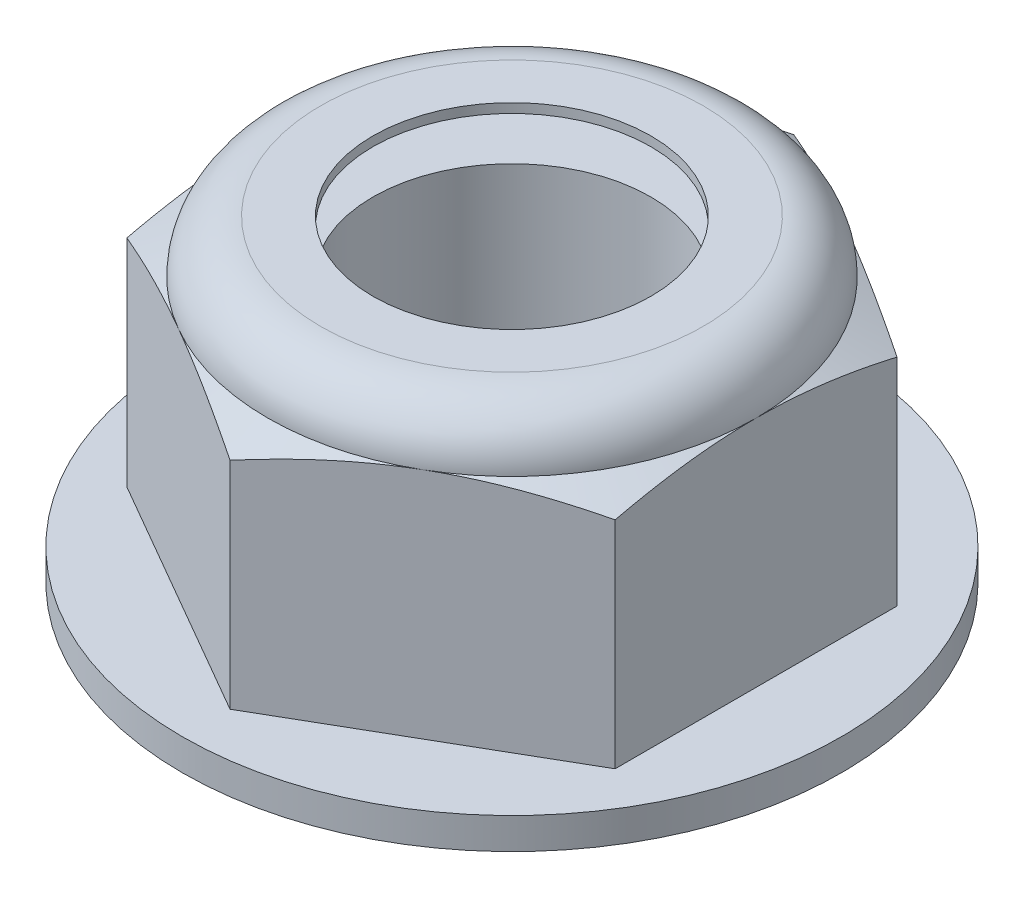
ISO-10303-21;
HEADER;
FILE_DESCRIPTION(('STEP AP214'),'2;1');
FILE_NAME('part.step','',(''),(''),'','','');
FILE_SCHEMA(('AUTOMOTIVE_DESIGN { 1 0 10303 214 1 1 1 1 }'));
ENDSEC;
DATA;
#1=APPLICATION_CONTEXT('core data for automotive mechanical design processes');
#2=APPLICATION_PROTOCOL_DEFINITION('international standard','automotive_design',2000,#1);
#3=PRODUCT_CONTEXT('',#1,'mechanical');
#4=PRODUCT('Part','Part','',(#3));
#5=PRODUCT_RELATED_PRODUCT_CATEGORY('part','',(#4));
#6=PRODUCT_DEFINITION_FORMATION('','',#4);
#7=PRODUCT_DEFINITION_CONTEXT('part definition',#1,'design');
#8=PRODUCT_DEFINITION('design','',#6,#7);
#9=PRODUCT_DEFINITION_SHAPE('','',#8);
#10=(LENGTH_UNIT() NAMED_UNIT(*) SI_UNIT(.MILLI.,.METRE.));
#11=(NAMED_UNIT(*) PLANE_ANGLE_UNIT() SI_UNIT($,.RADIAN.));
#12=(NAMED_UNIT(*) SI_UNIT($,.STERADIAN.) SOLID_ANGLE_UNIT());
#13=UNCERTAINTY_MEASURE_WITH_UNIT(LENGTH_MEASURE(1.E-05),#10,'distance_accuracy_value','');
#14=(GEOMETRIC_REPRESENTATION_CONTEXT(3) GLOBAL_UNCERTAINTY_ASSIGNED_CONTEXT((#13)) GLOBAL_UNIT_ASSIGNED_CONTEXT((#10,
#11,#12)) REPRESENTATION_CONTEXT('',''));
#15=CARTESIAN_POINT('',(0.,0.,0.));
#16=DIRECTION('',(0.,0.,1.));
#17=DIRECTION('',(1.,0.,0.));
#18=AXIS2_PLACEMENT_3D('',#15,#16,#17);
#19=CARTESIAN_POINT('',(0.,4.29947916666666,0.));
#20=DIRECTION('',(0.,-1.,0.));
#21=DIRECTION('',(0.,0.,-1.));
#22=AXIS2_PLACEMENT_3D('',#19,#20,#21);
#23=PLANE('',#22);
#24=CARTESIAN_POINT('',(0.,4.29947916666666,0.));
#25=DIRECTION('',(0.,-1.,0.));
#26=DIRECTION('',(0.,0.,-1.));
#27=AXIS2_PLACEMENT_3D('',#24,#25,#26);
#28=CIRCLE('',#27,2.25956488704734);
#29=CARTESIAN_POINT('',(0.,4.29947916666666,-2.25956488704734));
#30=VERTEX_POINT('',#29);
#31=EDGE_CURVE('E657',#30,#30,#28,.T.);
#32=ORIENTED_EDGE('',*,*,#31,.T.);
#33=EDGE_LOOP('',(#32));
#34=FACE_BOUND('',#33,.T.);
#35=CARTESIAN_POINT('',(0.,4.29947916666666,0.));
#36=DIRECTION('',(0.,-1.,0.));
#37=DIRECTION('',(0.,0.,-1.));
#38=AXIS2_PLACEMENT_3D('',#35,#36,#37);
#39=CIRCLE('',#38,3.81635);
#40=CARTESIAN_POINT('',(0.,4.29947916666666,-3.81635));
#41=VERTEX_POINT('',#40);
#42=EDGE_CURVE('E598',#41,#41,#39,.F.);
#43=ORIENTED_EDGE('',*,*,#42,.T.);
#44=EDGE_LOOP('',(#43));
#45=FACE_BOUND('',#44,.T.);
#46=ADVANCED_FACE('F55',(#34,#45),#23,.F.);
#47=CARTESIAN_POINT('',(0.,4.29947916666666,0.));
#48=DIRECTION('',(0.,-1.,0.));
#49=DIRECTION('',(0.,0.,-1.));
#50=AXIS2_PLACEMENT_3D('',#47,#48,#49);
#51=TOROIDAL_SURFACE('',#50,3.10885416666667,0.707495833333333);
#52=CARTESIAN_POINT('',(0.,5.00697499999999,0.));
#53=DIRECTION('',(0.,1.,0.));
#54=DIRECTION('',(0.,0.,-1.));
#55=AXIS2_PLACEMENT_3D('',#52,#53,#54);
#56=CIRCLE('',#55,3.10885416692067);
#57=CARTESIAN_POINT('',(0.,5.00697499999999,-3.10885416692067));
#58=VERTEX_POINT('',#57);
#59=EDGE_CURVE('E602',#58,#58,#56,.T.);
#60=ORIENTED_EDGE('',*,*,#59,.T.);
#61=EDGE_LOOP('',(#60));
#62=FACE_BOUND('',#61,.T.);
#63=ORIENTED_EDGE('',*,*,#42,.F.);
#64=EDGE_LOOP('',(#63));
#65=FACE_BOUND('',#64,.T.);
#66=ADVANCED_FACE('F621',(#62,#65),#51,.F.);
#67=CARTESIAN_POINT('',(0.,5.006975,-3.10885416666667));
#68=DIRECTION('',(0.,1.,0.));
#69=DIRECTION('',(0.,0.,1.));
#70=AXIS2_PLACEMENT_3D('',#67,#68,#69);
#71=PLANE('',#70);
#72=CARTESIAN_POINT('',(0.,5.006975,0.));
#73=DIRECTION('',(0.,1.,0.));
#74=DIRECTION('',(0.,0.,1.));
#75=AXIS2_PLACEMENT_3D('',#72,#73,#74);
#76=CIRCLE('',#75,2.25956488704734);
#77=CARTESIAN_POINT('',(0.,5.006975,2.25956488704734));
#78=VERTEX_POINT('',#77);
#79=EDGE_CURVE('E60',#78,#78,#76,.T.);
#80=ORIENTED_EDGE('',*,*,#79,.T.);
#81=EDGE_LOOP('',(#80));
#82=FACE_BOUND('',#81,.T.);
#83=ORIENTED_EDGE('',*,*,#59,.F.);
#84=EDGE_LOOP('',(#83));
#85=FACE_BOUND('',#84,.T.);
#86=ADVANCED_FACE('F610',(#82,#85),#71,.F.);
#87=CARTESIAN_POINT('',(0.,5.159375,0.));
#88=DIRECTION('',(0.,1.,0.));
#89=DIRECTION('',(0.,0.,1.));
#90=AXIS2_PLACEMENT_3D('',#87,#88,#89);
#91=CYLINDRICAL_SURFACE('',#90,2.25956488704734);
#92=CARTESIAN_POINT('',(0.,5.159375,0.));
#93=DIRECTION('',(0.,1.,0.));
#94=DIRECTION('',(0.,0.,1.));
#95=AXIS2_PLACEMENT_3D('',#92,#93,#94);
#96=CIRCLE('',#95,2.25956488704734);
#97=CARTESIAN_POINT('',(0.,5.159375,2.25956488704734));
#98=VERTEX_POINT('',#97);
#99=EDGE_CURVE('E918',#98,#98,#96,.T.);
#100=ORIENTED_EDGE('',*,*,#99,.T.);
#101=EDGE_LOOP('',(#100));
#102=FACE_BOUND('',#101,.T.);
#103=ORIENTED_EDGE('',*,*,#79,.F.);
#104=EDGE_LOOP('',(#103));
#105=FACE_BOUND('',#104,.T.);
#106=ADVANCED_FACE('F620',(#102,#105),#91,.F.);
#107=ORIENTED_EDGE('',*,*,#31,.F.);
#108=EDGE_LOOP('',(#107));
#109=FACE_BOUND('',#108,.T.);
#110=CARTESIAN_POINT('',(0.,0.,0.));
#111=DIRECTION('',(0.,1.,0.));
#112=DIRECTION('',(0.,0.,1.));
#113=AXIS2_PLACEMENT_3D('',#110,#111,#112);
#114=CIRCLE('',#113,2.25956488704734);
#115=CARTESIAN_POINT('',(0.,0.,2.25956488704734));
#116=VERTEX_POINT('',#115);
#117=EDGE_CURVE('E603',#116,#116,#114,.T.);
#118=ORIENTED_EDGE('',*,*,#117,.F.);
#119=EDGE_LOOP('',(#118));
#120=FACE_BOUND('',#119,.T.);
#121=ADVANCED_FACE('F646',(#109,#120),#91,.F.);
#122=CARTESIAN_POINT('',(0.,5.159375,-4.58271776169266));
#123=DIRECTION('',(0.,1.,0.));
#124=DIRECTION('',(0.,0.,1.));
#125=AXIS2_PLACEMENT_3D('',#122,#123,#124);
#126=PLANE('',#125);
#127=ORIENTED_EDGE('',*,*,#99,.F.);
#128=EDGE_LOOP('',(#127));
#129=FACE_BOUND('',#128,.T.);
#130=CARTESIAN_POINT('',(0.,5.15937499999999,0.));
#131=DIRECTION('',(0.,-1.,0.));
#132=DIRECTION('',(0.,0.,-1.));
#133=AXIS2_PLACEMENT_3D('',#130,#131,#132);
#134=CIRCLE('',#133,3.10885416692067);
#135=CARTESIAN_POINT('',(0.,5.15937499999999,-3.10885416692067));
#136=VERTEX_POINT('',#135);
#137=EDGE_CURVE('E189',#136,#136,#134,.T.);
#138=ORIENTED_EDGE('',*,*,#137,.F.);
#139=EDGE_LOOP('',(#138));
#140=FACE_BOUND('',#139,.T.);
#141=ADVANCED_FACE('F57',(#129,#140),#126,.T.);
#142=CARTESIAN_POINT('',(0.,4.29947916666666,0.));
#143=DIRECTION('',(0.,-1.,0.));
#144=DIRECTION('',(0.,0.,-1.));
#145=AXIS2_PLACEMENT_3D('',#142,#143,#144);
#146=TOROIDAL_SURFACE('',#145,3.10885416666667,0.859895833333333);
#147=ORIENTED_EDGE('',*,*,#137,.T.);
#148=EDGE_LOOP('',(#147));
#149=FACE_BOUND('',#148,.T.);
#150=CARTESIAN_POINT('',(0.,4.29947916663309,0.));
#151=DIRECTION('',(0.,-1.,0.));
#152=DIRECTION('',(0.,0.,-1.));
#153=AXIS2_PLACEMENT_3D('',#150,#151,#152);
#154=CIRCLE('',#153,3.96875000001273);
#155=CARTESIAN_POINT('',(3.96875000000637,4.29947916663606,0.));
#156=VERTEX_POINT('',#155);
#157=CARTESIAN_POINT('',(1.98437500000318,4.29947916663606,3.437038321275));
#158=VERTEX_POINT('',#157);
#159=EDGE_CURVE('E541',#156,#158,#154,.T.);
#160=ORIENTED_EDGE('',*,*,#159,.F.);
#161=CARTESIAN_POINT('',(0.,4.29947916663309,0.));
#162=DIRECTION('',(0.,-1.,0.));
#163=DIRECTION('',(0.,0.,-1.));
#164=AXIS2_PLACEMENT_3D('',#161,#162,#163);
#165=CIRCLE('',#164,3.96875000001273);
#166=CARTESIAN_POINT('',(1.98437500000318,4.29947916663606,-3.437038321275));
#167=VERTEX_POINT('',#166);
#168=EDGE_CURVE('E172',#167,#156,#165,.T.);
#169=ORIENTED_EDGE('',*,*,#168,.F.);
#170=CARTESIAN_POINT('',(0.,4.29947916663309,0.));
#171=DIRECTION('',(0.,-1.,0.));
#172=DIRECTION('',(0.,0.,-1.));
#173=AXIS2_PLACEMENT_3D('',#170,#171,#172);
#174=CIRCLE('',#173,3.96875000001273);
#175=CARTESIAN_POINT('',(-1.98437500000319,4.29947916663606,-3.43703832127501));
#176=VERTEX_POINT('',#175);
#177=EDGE_CURVE('E168',#176,#167,#174,.T.);
#178=ORIENTED_EDGE('',*,*,#177,.F.);
#179=CARTESIAN_POINT('',(0.,4.29947916663309,0.));
#180=DIRECTION('',(0.,-1.,0.));
#181=DIRECTION('',(0.,0.,-1.));
#182=AXIS2_PLACEMENT_3D('',#179,#180,#181);
#183=CIRCLE('',#182,3.96875000001273);
#184=CARTESIAN_POINT('',(-3.96875000000637,4.29947916663606,0.));
#185=VERTEX_POINT('',#184);
#186=EDGE_CURVE('E182',#185,#176,#183,.T.);
#187=ORIENTED_EDGE('',*,*,#186,.F.);
#188=CARTESIAN_POINT('',(0.,4.29947916663309,0.));
#189=DIRECTION('',(0.,-1.,0.));
#190=DIRECTION('',(0.,0.,-1.));
#191=AXIS2_PLACEMENT_3D('',#188,#189,#190);
#192=CIRCLE('',#191,3.96875000001273);
#193=CARTESIAN_POINT('',(-1.98437500000318,4.29947916663606,3.43703832127501));
#194=VERTEX_POINT('',#193);
#195=EDGE_CURVE('E188',#194,#185,#192,.T.);
#196=ORIENTED_EDGE('',*,*,#195,.F.);
#197=CARTESIAN_POINT('',(0.,4.29947916663309,0.));
#198=DIRECTION('',(0.,-1.,0.));
#199=DIRECTION('',(0.,0.,-1.));
#200=AXIS2_PLACEMENT_3D('',#197,#198,#199);
#201=CIRCLE('',#200,3.96875000001273);
#202=EDGE_CURVE('E546',#158,#194,#201,.T.);
#203=ORIENTED_EDGE('',*,*,#202,.F.);
#204=EDGE_LOOP('',(#160,#169,#178,#187,#196,#203));
#205=FACE_BOUND('',#204,.T.);
#206=ADVANCED_FACE('F196',(#149,#205),#146,.T.);
#207=CARTESIAN_POINT('',(0.,4.01146351026682,0.));
#208=DIRECTION('',(0.,-1.,0.));
#209=DIRECTION('',(0.,0.,-1.));
#210=AXIS2_PLACEMENT_3D('',#207,#208,#209);
#211=CONICAL_SURFACE('',#210,4.58640156836054,1.13446401383057);
#212=ORIENTED_EDGE('',*,*,#177,.T.);
#213=CARTESIAN_POINT('',(1.984375,4.29947916663903,-3.43703832126949));
#214=CARTESIAN_POINT('',(1.90068202425308,4.29949063606755,-3.48535848334626));
#215=CARTESIAN_POINT('',(1.81699140878912,4.29783343713999,-3.53367728271302));
#216=CARTESIAN_POINT('',(1.64971517236388,4.29126659423326,-3.63025426284216));
#217=CARTESIAN_POINT('',(1.56612954044007,4.28635732411621,-3.67851244993376));
#218=CARTESIAN_POINT('',(1.39942198510236,4.27339279209317,-3.77476110188393));
#219=CARTESIAN_POINT('',(1.3162994440687,4.26534804900737,-3.82275192332544));
#220=CARTESIAN_POINT('',(1.15031301246905,4.24626834965072,-3.91858423429132));
#221=CARTESIAN_POINT('',(1.06744912557862,4.23523335108123,-3.96642572169361));
#222=CARTESIAN_POINT('',(0.81947163893657,4.19794138638942,-4.10959559035936));
#223=CARTESIAN_POINT('',(0.654830633226207,4.16748584915722,-4.20465111932589));
#224=CARTESIAN_POINT('',(0.326497291191042,4.09704577757764,-4.39421446273382));
#225=CARTESIAN_POINT('',(0.162810026905678,4.05702945278584,-4.48871934883189));
#226=CARTESIAN_POINT('',(-3.31893085215347E-08,4.01318128859175,-4.58271778085451));
#227=B_SPLINE_CURVE_WITH_KNOTS('',3,(#213,#214,#215,#216,#217,#218,#219,#220,#221,#222,#223,
#224,#225,#226),.UNSPECIFIED.,.F.,.F.,(4,2,2,2,2,2,4),(0.,0.289902364590457,0.579771407428602,
0.868676259763257,1.15758519901256,1.73491225609728,2.3141863669809),.UNSPECIFIED.);
#228=CARTESIAN_POINT('',(-3.92447085080745E-08,4.01318130809264,-4.58271773903472));
#229=VERTEX_POINT('',#228);
#230=EDGE_CURVE('E150',#167,#229,#227,.T.);
#231=ORIENTED_EDGE('',*,*,#230,.T.);
#232=CARTESIAN_POINT('',(-7.84924973823098E-08,4.0131813186638,-4.58271771638472));
#233=CARTESIAN_POINT('',(-0.162810129620303,4.05702947859696,-4.48871928953298));
#234=CARTESIAN_POINT('',(-0.326497384841775,4.09704579935415,-4.39421440866544));
#235=CARTESIAN_POINT('',(-0.654830708632123,4.16748586366253,-4.20465107578938));
#236=CARTESIAN_POINT('',(-0.819471705162628,4.19794139765291,-4.10959555212357));
#237=CARTESIAN_POINT('',(-1.06744917787535,4.23523335829211,-3.96642569150016));
#238=CARTESIAN_POINT('',(-1.15031306008803,4.24626835564492,-3.91858420679851));
#239=CARTESIAN_POINT('',(-1.31629948229136,4.26534805288065,-3.82275190125755));
#240=CARTESIAN_POINT('',(-1.39942201860645,4.2733927950622,-3.77476108254033));
#241=CARTESIAN_POINT('',(-1.56612956443773,4.28635732561832,-3.67851243607871));
#242=CARTESIAN_POINT('',(-1.64971519157353,4.29126659517472,-3.63025425175147));
#243=CARTESIAN_POINT('',(-1.81699141840376,4.29783343732903,-3.533677277162));
#244=CARTESIAN_POINT('',(-1.90068202906072,4.29949063606494,-3.48535848057056));
#245=CARTESIAN_POINT('',(-1.984375,4.29947916663903,-3.43703832126949));
#246=B_SPLINE_CURVE_WITH_KNOTS('',3,(#232,#233,#234,#235,#236,#237,#238,#239,#240,#241,#242,
#243,#244,#245),.UNSPECIFIED.,.F.,.F.,(4,2,2,2,2,2,4),(0.,0.579274077705198,1.15660110188365,
1.44551002462398,1.7344148604513,2.02428388664847,2.31418623458842),.UNSPECIFIED.);
#247=EDGE_CURVE('E127',#229,#176,#246,.T.);
#248=ORIENTED_EDGE('',*,*,#247,.T.);
#249=EDGE_LOOP('',(#212,#231,#248));
#250=FACE_BOUND('',#249,.T.);
#251=ADVANCED_FACE('F200',(#250),#211,.T.);
#252=CARTESIAN_POINT('',(0.,4.01146351026682,0.));
#253=DIRECTION('',(0.,-1.,0.));
#254=DIRECTION('',(0.,0.,-1.));
#255=AXIS2_PLACEMENT_3D('',#252,#253,#254);
#256=CONICAL_SURFACE('',#255,4.58640156836054,1.13446401383057);
#257=CARTESIAN_POINT('',(-1.984375,4.29947916663903,-3.43703832126949));
#258=CARTESIAN_POINT('',(-2.06806797431815,4.29949063606677,-3.38871816001764));
#259=CARTESIAN_POINT('',(-2.15175858835351,4.29783343719617,-3.34039936147567));
#260=CARTESIAN_POINT('',(-2.31903482192722,4.29126659451305,-3.24382238299287));
#261=CARTESIAN_POINT('',(-2.40262045242808,4.28635732456262,-3.19556419672281));
#262=CARTESIAN_POINT('',(-2.56932800494057,4.27339279297554,-3.09931554640378));
#263=CARTESIAN_POINT('',(-2.65245054457191,4.26534805015848,-3.0513247257719));
#264=CARTESIAN_POINT('',(-2.81843697337906,4.24626835143213,-2.95549241641827));
#265=CARTESIAN_POINT('',(-2.90130085887931,4.23523335322422,-2.9076509298186));
#266=CARTESIAN_POINT('',(-3.14927834138169,4.19794138973685,-2.76448106354289));
#267=CARTESIAN_POINT('',(-3.31391934436383,4.1674858534682,-2.6694255361515));
#268=CARTESIAN_POINT('',(-3.64225268097702,4.09704578404924,-2.47986219587394));
#269=CARTESIAN_POINT('',(-3.80593994256895,4.05702946045605,-2.38535731133093));
#270=CARTESIAN_POINT('',(-3.96874999999962,4.01318129752717,-2.29135888084656));
#271=B_SPLINE_CURVE_WITH_KNOTS('',3,(#257,#258,#259,#260,#261,#262,#263,#264,#265,#266,#267,
#268,#269,#270),.UNSPECIFIED.,.F.,.F.,(4,2,2,2,2,2,4),(0.,0.289902359642105,0.579771397534721,
0.868676244963538,1.15758517930653,1.73491222661187,2.31418632763527),.UNSPECIFIED.);
#272=CARTESIAN_POINT('',(-3.96874999999981,4.01318129752717,-2.29135888084621));
#273=VERTEX_POINT('',#272);
#274=EDGE_CURVE('E390',#176,#273,#271,.T.);
#275=ORIENTED_EDGE('',*,*,#274,.T.);
#276=CARTESIAN_POINT('',(-3.96875,4.01318129752717,-2.29135888084587));
#277=CARTESIAN_POINT('',(-3.96875,4.05702946045605,-2.10336201987713));
#278=CARTESIAN_POINT('',(-3.96875,4.09704578404925,-1.9143522507911));
#279=CARTESIAN_POINT('',(-3.96875,4.16748585346821,-1.53522557023599));
#280=CARTESIAN_POINT('',(-3.96875,4.19794138973685,-1.34511451545321));
#281=CARTESIAN_POINT('',(-3.96875,4.23523335322423,-1.05877478290179));
#282=CARTESIAN_POINT('',(-3.96875,4.24626835143214,-0.963091809702455));
#283=CARTESIAN_POINT('',(-3.96875,4.26534805015848,-0.771427190995189));
#284=CARTESIAN_POINT('',(-3.96875,4.27339279297554,-0.675445549731429));
#285=CARTESIAN_POINT('',(-3.96875,4.28635732456262,-0.482948249093372));
#286=CARTESIAN_POINT('',(-3.96875,4.29126659451305,-0.386431876553257));
#287=CARTESIAN_POINT('',(-3.96875,4.29783343719618,-0.193277919587646));
#288=CARTESIAN_POINT('',(-3.96875,4.29949063606677,-0.0966403225037178));
#289=CARTESIAN_POINT('',(-3.96875,4.29947916663903,0.));
#290=B_SPLINE_CURVE_WITH_KNOTS('',3,(#276,#277,#278,#279,#280,#281,#282,#283,#284,#285,#286,
#287,#288,#289),.UNSPECIFIED.,.F.,.F.,(4,2,2,2,2,2,4),(0.,0.579274101023395,1.15660114832874,
1.44551008267172,1.73441493010054,2.02428396799316,2.31418632763526),.UNSPECIFIED.);
#291=EDGE_CURVE('E516',#273,#185,#290,.T.);
#292=ORIENTED_EDGE('',*,*,#291,.T.);
#293=ORIENTED_EDGE('',*,*,#186,.T.);
#294=EDGE_LOOP('',(#275,#292,#293));
#295=FACE_BOUND('',#294,.T.);
#296=ADVANCED_FACE('F202',(#295),#256,.T.);
#297=CARTESIAN_POINT('',(0.,4.01146351026682,0.));
#298=DIRECTION('',(0.,-1.,0.));
#299=DIRECTION('',(0.,0.,-1.));
#300=AXIS2_PLACEMENT_3D('',#297,#298,#299);
#301=CONICAL_SURFACE('',#300,4.58640156836054,1.13446401383057);
#302=ORIENTED_EDGE('',*,*,#195,.T.);
#303=CARTESIAN_POINT('',(-3.96875,4.29947916663903,0.));
#304=CARTESIAN_POINT('',(-3.96875,4.29949063606677,0.0966403225037192));
#305=CARTESIAN_POINT('',(-3.96875,4.29783343719618,0.193277919587648));
#306=CARTESIAN_POINT('',(-3.96875,4.29126659451305,0.386431876553259));
#307=CARTESIAN_POINT('',(-3.96875,4.28635732456262,0.482948249093374));
#308=CARTESIAN_POINT('',(-3.96875,4.27339279297554,0.675445549731432));
#309=CARTESIAN_POINT('',(-3.96875,4.26534805015848,0.771427190995192));
#310=CARTESIAN_POINT('',(-3.96875,4.24626835143214,0.963091809702459));
#311=CARTESIAN_POINT('',(-3.96875,4.23523335322423,1.05877478290179));
#312=CARTESIAN_POINT('',(-3.96875,4.19794138973685,1.34511451545322));
#313=CARTESIAN_POINT('',(-3.96875,4.16748585346821,1.535225570236));
#314=CARTESIAN_POINT('',(-3.96875,4.09704578404925,1.9143522507911));
#315=CARTESIAN_POINT('',(-3.96875,4.05702946045605,2.10336201987713));
#316=CARTESIAN_POINT('',(-3.96875,4.01318129752717,2.29135888084588));
#317=B_SPLINE_CURVE_WITH_KNOTS('',3,(#303,#304,#305,#306,#307,#308,#309,#310,#311,#312,#313,
#314,#315,#316),.UNSPECIFIED.,.F.,.F.,(4,2,2,2,2,2,4),(0.,0.289902359642105,0.579771397534722,
0.868676244963539,1.15758517930653,1.73491222661187,2.31418632763527),.UNSPECIFIED.);
#318=CARTESIAN_POINT('',(-3.96874999999981,4.01318129752717,2.29135888084622));
#319=VERTEX_POINT('',#318);
#320=EDGE_CURVE('E510',#185,#319,#317,.T.);
#321=ORIENTED_EDGE('',*,*,#320,.T.);
#322=CARTESIAN_POINT('',(-3.96874999999961,4.01318129752717,2.29135888084656));
#323=CARTESIAN_POINT('',(-3.80593994256894,4.05702946045605,2.38535731133093));
#324=CARTESIAN_POINT('',(-3.64225268097701,4.09704578404925,2.47986219587394));
#325=CARTESIAN_POINT('',(-3.31391934436382,4.16748585346821,2.6694255361515));
#326=CARTESIAN_POINT('',(-3.14927834138168,4.19794138973685,2.76448106354289));
#327=CARTESIAN_POINT('',(-2.9013008588793,4.23523335322422,2.9076509298186));
#328=CARTESIAN_POINT('',(-2.81843697337906,4.24626835143213,2.95549241641826));
#329=CARTESIAN_POINT('',(-2.65245054457191,4.26534805015848,3.0513247257719));
#330=CARTESIAN_POINT('',(-2.56932800494056,4.27339279297554,3.09931554640378));
#331=CARTESIAN_POINT('',(-2.40262045242808,4.28635732456262,3.19556419672281));
#332=CARTESIAN_POINT('',(-2.31903482192721,4.29126659451305,3.24382238299286));
#333=CARTESIAN_POINT('',(-2.15175858835351,4.29783343719618,3.34039936147567));
#334=CARTESIAN_POINT('',(-2.06806797431814,4.29949063606677,3.38871816001763));
#335=CARTESIAN_POINT('',(-1.984375,4.29947916663903,3.43703832126949));
#336=B_SPLINE_CURVE_WITH_KNOTS('',3,(#322,#323,#324,#325,#326,#327,#328,#329,#330,#331,#332,
#333,#334,#335),.UNSPECIFIED.,.F.,.F.,(4,2,2,2,2,2,4),(0.,0.579274101023396,1.15660114832874,
1.44551008267173,1.73441493010054,2.02428396799316,2.31418632763526),.UNSPECIFIED.);
#337=EDGE_CURVE('E492',#319,#194,#336,.T.);
#338=ORIENTED_EDGE('',*,*,#337,.T.);
#339=EDGE_LOOP('',(#302,#321,#338));
#340=FACE_BOUND('',#339,.T.);
#341=ADVANCED_FACE('F472',(#340),#301,.T.);
#342=CARTESIAN_POINT('',(0.,4.01146351026682,0.));
#343=DIRECTION('',(0.,-1.,0.));
#344=DIRECTION('',(0.,0.,-1.));
#345=AXIS2_PLACEMENT_3D('',#342,#343,#344);
#346=CONICAL_SURFACE('',#345,4.58640156836054,1.13446401383057);
#347=ORIENTED_EDGE('',*,*,#202,.T.);
#348=CARTESIAN_POINT('',(-1.984375,4.29947916663903,3.43703832126949));
#349=CARTESIAN_POINT('',(-1.90068202568186,4.29949063606677,3.48535848252135));
#350=CARTESIAN_POINT('',(-1.81699141164649,4.29783343719618,3.53367728106332));
#351=CARTESIAN_POINT('',(-1.64971517807279,4.29126659451305,3.63025425954612));
#352=CARTESIAN_POINT('',(-1.56612954757192,4.28635732456262,3.67851244581618));
#353=CARTESIAN_POINT('',(-1.39942199505944,4.27339279297554,3.77476109613521));
#354=CARTESIAN_POINT('',(-1.3162994554281,4.26534805015848,3.82275191676709));
#355=CARTESIAN_POINT('',(-1.15031302662095,4.24626835143213,3.91858422612072));
#356=CARTESIAN_POINT('',(-1.0674491411207,4.23523335322422,3.96642571272039));
#357=CARTESIAN_POINT('',(-0.819471658618321,4.19794138973685,4.1095955789961));
#358=CARTESIAN_POINT('',(-0.654830655636181,4.16748585346821,4.20465110638749));
#359=CARTESIAN_POINT('',(-0.32649731902299,4.09704578404925,4.39421444666504));
#360=CARTESIAN_POINT('',(-0.162810057431059,4.05702946045605,4.48871933120806));
#361=CARTESIAN_POINT('',(-3.93154487261169E-13,4.01318129752717,4.58271776169243));
#362=B_SPLINE_CURVE_WITH_KNOTS('',3,(#348,#349,#350,#351,#352,#353,#354,#355,#356,#357,#358,
#359,#360,#361),.UNSPECIFIED.,.F.,.F.,(4,2,2,2,2,2,4),(0.,0.289902359642104,0.57977139753472,
0.868676244963536,1.15758517930652,1.73491222661186,2.31418632763526),.UNSPECIFIED.);
#363=CARTESIAN_POINT('',(0.,4.01318129752717,4.58271776169243));
#364=VERTEX_POINT('',#363);
#365=EDGE_CURVE('E483',#194,#364,#362,.T.);
#366=ORIENTED_EDGE('',*,*,#365,.T.);
#367=CARTESIAN_POINT('',(3.83947240191902E-13,4.01318129752717,4.58271776169243));
#368=CARTESIAN_POINT('',(0.162810057431051,4.05702946045605,4.48871933120805));
#369=CARTESIAN_POINT('',(0.326497319022983,4.09704578404925,4.39421444666504));
#370=CARTESIAN_POINT('',(0.654830655636174,4.16748585346821,4.20465110638748));
#371=CARTESIAN_POINT('',(0.819471658618315,4.19794138973685,4.1095955789961));
#372=CARTESIAN_POINT('',(1.06744914112069,4.23523335322423,3.96642571272038));
#373=CARTESIAN_POINT('',(1.15031302662094,4.24626835143214,3.91858422612072));
#374=CARTESIAN_POINT('',(1.31629945542809,4.26534805015848,3.82275191676708));
#375=CARTESIAN_POINT('',(1.39942199505943,4.27339279297554,3.7747610961352));
#376=CARTESIAN_POINT('',(1.56612954757192,4.28635732456262,3.67851244581617));
#377=CARTESIAN_POINT('',(1.64971517807278,4.29126659451306,3.63025425954612));
#378=CARTESIAN_POINT('',(1.81699141164649,4.29783343719618,3.53367728106331));
#379=CARTESIAN_POINT('',(1.90068202568186,4.29949063606678,3.48535848252135));
#380=CARTESIAN_POINT('',(1.984375,4.29947916663903,3.43703832126949));
#381=B_SPLINE_CURVE_WITH_KNOTS('',3,(#367,#368,#369,#370,#371,#372,#373,#374,#375,#376,#377,
#378,#379,#380),.UNSPECIFIED.,.F.,.F.,(4,2,2,2,2,2,4),(0.,0.579274101023398,1.15660114832874,
1.44551008267173,1.73441493010055,2.02428396799316,2.31418632763527),.UNSPECIFIED.);
#382=EDGE_CURVE('E476',#364,#158,#381,.T.);
#383=ORIENTED_EDGE('',*,*,#382,.T.);
#384=EDGE_LOOP('',(#347,#366,#383));
#385=FACE_BOUND('',#384,.T.);
#386=ADVANCED_FACE('F467',(#385),#346,.T.);
#387=CARTESIAN_POINT('',(0.,4.01146351026682,0.));
#388=DIRECTION('',(0.,-1.,0.));
#389=DIRECTION('',(0.,0.,-1.));
#390=AXIS2_PLACEMENT_3D('',#387,#388,#389);
#391=CONICAL_SURFACE('',#390,4.58640156836054,1.13446401383057);
#392=ORIENTED_EDGE('',*,*,#159,.T.);
#393=CARTESIAN_POINT('',(1.984375,4.29947916663903,3.43703832126949));
#394=CARTESIAN_POINT('',(2.06806797431814,4.29949063606678,3.38871816001763));
#395=CARTESIAN_POINT('',(2.15175858835351,4.29783343719618,3.34039936147566));
#396=CARTESIAN_POINT('',(2.31903482192721,4.29126659451305,3.24382238299286));
#397=CARTESIAN_POINT('',(2.40262045242807,4.28635732456262,3.1955641967228));
#398=CARTESIAN_POINT('',(2.56932800494056,4.27339279297554,3.09931554640377));
#399=CARTESIAN_POINT('',(2.6524505445719,4.26534805015848,3.05132472577189));
#400=CARTESIAN_POINT('',(2.81843697337905,4.24626835143214,2.95549241641826));
#401=CARTESIAN_POINT('',(2.9013008588793,4.23523335322423,2.90765092981859));
#402=CARTESIAN_POINT('',(3.14927834138168,4.19794138973685,2.76448106354288));
#403=CARTESIAN_POINT('',(3.31391934436382,4.16748585346821,2.66942553615149));
#404=CARTESIAN_POINT('',(3.64225268097701,4.09704578404925,2.47986219587394));
#405=CARTESIAN_POINT('',(3.80593994256894,4.05702946045605,2.38535731133092));
#406=CARTESIAN_POINT('',(3.96874999999961,4.01318129752717,2.29135888084655));
#407=B_SPLINE_CURVE_WITH_KNOTS('',3,(#393,#394,#395,#396,#397,#398,#399,#400,#401,#402,#403,
#404,#405,#406),.UNSPECIFIED.,.F.,.F.,(4,2,2,2,2,2,4),(0.,0.289902359642104,0.57977139753472,
0.868676244963537,1.15758517930653,1.73491222661187,2.31418632763526),.UNSPECIFIED.);
#408=CARTESIAN_POINT('',(3.9687499999998,4.01318129752717,2.29135888084621));
#409=VERTEX_POINT('',#408);
#410=EDGE_CURVE('E455',#158,#409,#407,.T.);
#411=ORIENTED_EDGE('',*,*,#410,.T.);
#412=CARTESIAN_POINT('',(3.96875,4.01318129752717,2.29135888084588));
#413=CARTESIAN_POINT('',(3.96875,4.05702946045605,2.10336201987713));
#414=CARTESIAN_POINT('',(3.96875,4.09704578404925,1.9143522507911));
#415=CARTESIAN_POINT('',(3.96875,4.16748585346821,1.53522557023599));
#416=CARTESIAN_POINT('',(3.96875,4.19794138973685,1.34511451545322));
#417=CARTESIAN_POINT('',(3.96875,4.23523335322423,1.05877478290179));
#418=CARTESIAN_POINT('',(3.96875,4.24626835143214,0.963091809702457));
#419=CARTESIAN_POINT('',(3.96875,4.26534805015848,0.77142719099519));
#420=CARTESIAN_POINT('',(3.96875,4.27339279297554,0.675445549731431));
#421=CARTESIAN_POINT('',(3.96875,4.28635732456262,0.482948249093373));
#422=CARTESIAN_POINT('',(3.96875,4.29126659451305,0.386431876553258));
#423=CARTESIAN_POINT('',(3.96875,4.29783343719618,0.193277919587647));
#424=CARTESIAN_POINT('',(3.96875,4.29949063606677,0.0966403225037178));
#425=CARTESIAN_POINT('',(3.96875,4.29947916663903,0.));
#426=B_SPLINE_CURVE_WITH_KNOTS('',3,(#412,#413,#414,#415,#416,#417,#418,#419,#420,#421,#422,
#423,#424,#425),.UNSPECIFIED.,.F.,.F.,(4,2,2,2,2,2,4),(0.,0.579274101023397,1.15660114832874,
1.44551008267173,1.73441493010054,2.02428396799316,2.31418632763526),.UNSPECIFIED.);
#427=EDGE_CURVE('E445',#409,#156,#426,.T.);
#428=ORIENTED_EDGE('',*,*,#427,.T.);
#429=EDGE_LOOP('',(#392,#411,#428));
#430=FACE_BOUND('',#429,.T.);
#431=ADVANCED_FACE('F463',(#430),#391,.T.);
#432=CARTESIAN_POINT('',(0.,4.01146351026682,0.));
#433=DIRECTION('',(0.,-1.,0.));
#434=DIRECTION('',(0.,0.,-1.));
#435=AXIS2_PLACEMENT_3D('',#432,#433,#434);
#436=CONICAL_SURFACE('',#435,4.58640156836054,1.13446401383057);
#437=CARTESIAN_POINT('',(3.96875,4.29947916663903,0.));
#438=CARTESIAN_POINT('',(3.96875,4.29949063606677,-0.0966403225037192));
#439=CARTESIAN_POINT('',(3.96875,4.29783343719618,-0.193277919587648));
#440=CARTESIAN_POINT('',(3.96875,4.29126659451305,-0.386431876553259));
#441=CARTESIAN_POINT('',(3.96875,4.28635732456262,-0.482948249093374));
#442=CARTESIAN_POINT('',(3.96875,4.27339279297554,-0.675445549731432));
#443=CARTESIAN_POINT('',(3.96875,4.26534805015848,-0.771427190995192));
#444=CARTESIAN_POINT('',(3.96875,4.24626835143214,-0.963091809702459));
#445=CARTESIAN_POINT('',(3.96875,4.23523335322423,-1.05877478290179));
#446=CARTESIAN_POINT('',(3.96875,4.19794138973685,-1.34511451545322));
#447=CARTESIAN_POINT('',(3.96875,4.16748585346821,-1.535225570236));
#448=CARTESIAN_POINT('',(3.96875,4.09704578404925,-1.9143522507911));
#449=CARTESIAN_POINT('',(3.96875,4.05702946045605,-2.10336201987713));
#450=CARTESIAN_POINT('',(3.96875,4.01318129752717,-2.29135888084588));
#451=B_SPLINE_CURVE_WITH_KNOTS('',3,(#437,#438,#439,#440,#441,#442,#443,#444,#445,#446,#447,
#448,#449,#450),.UNSPECIFIED.,.F.,.F.,(4,2,2,2,2,2,4),(0.,0.289902359642105,0.579771397534721,
0.868676244963538,1.15758517930653,1.73491222661187,2.31418632763527),.UNSPECIFIED.);
#452=CARTESIAN_POINT('',(3.96874999999981,4.01318129752717,-2.29135888084622));
#453=VERTEX_POINT('',#452);
#454=EDGE_CURVE('E438',#156,#453,#451,.T.);
#455=ORIENTED_EDGE('',*,*,#454,.T.);
#456=CARTESIAN_POINT('',(3.96874999999961,4.01318129752717,-2.29135888084656));
#457=CARTESIAN_POINT('',(3.80593994256894,4.05702946045605,-2.38535731133093));
#458=CARTESIAN_POINT('',(3.64225268097701,4.09704578404925,-2.47986219587394));
#459=CARTESIAN_POINT('',(3.31391934436382,4.16748585346821,-2.6694255361515));
#460=CARTESIAN_POINT('',(3.14927834138168,4.19794138973685,-2.76448106354289));
#461=CARTESIAN_POINT('',(2.90130085887931,4.23523335322422,-2.9076509298186));
#462=CARTESIAN_POINT('',(2.81843697337906,4.24626835143213,-2.95549241641826));
#463=CARTESIAN_POINT('',(2.65245054457191,4.26534805015848,-3.0513247257719));
#464=CARTESIAN_POINT('',(2.56932800494057,4.27339279297554,-3.09931554640378));
#465=CARTESIAN_POINT('',(2.40262045242808,4.28635732456262,-3.19556419672281));
#466=CARTESIAN_POINT('',(2.31903482192722,4.29126659451305,-3.24382238299286));
#467=CARTESIAN_POINT('',(2.15175858835351,4.29783343719618,-3.34039936147567));
#468=CARTESIAN_POINT('',(2.06806797431814,4.29949063606677,-3.38871816001763));
#469=CARTESIAN_POINT('',(1.984375,4.29947916663903,-3.43703832126949));
#470=B_SPLINE_CURVE_WITH_KNOTS('',3,(#456,#457,#458,#459,#460,#461,#462,#463,#464,#465,#466,
#467,#468,#469),.UNSPECIFIED.,.F.,.F.,(4,2,2,2,2,2,4),(0.,0.579274101023397,1.15660114832874,
1.44551008267173,1.73441493010054,2.02428396799316,2.31418632763526),.UNSPECIFIED.);
#471=EDGE_CURVE('E415',#453,#167,#470,.T.);
#472=ORIENTED_EDGE('',*,*,#471,.T.);
#473=ORIENTED_EDGE('',*,*,#168,.T.);
#474=EDGE_LOOP('',(#455,#472,#473));
#475=FACE_BOUND('',#474,.T.);
#476=ADVANCED_FACE('F403',(#475),#436,.T.);
#477=CARTESIAN_POINT('',(3.96875,5.159375,-2.29135888084633));
#478=DIRECTION('',(-0.5,0.,0.866025403784439));
#479=DIRECTION('',(0.866025403784439,0.,0.5));
#480=AXIS2_PLACEMENT_3D('',#477,#478,#479);
#481=PLANE('',#480);
#482=ORIENTED_EDGE('',*,*,#230,.F.);
#483=ORIENTED_EDGE('',*,*,#471,.F.);
#484=DIRECTION('',(0.,1.,0.));
#485=VECTOR('',#484,1.);
#486=CARTESIAN_POINT('',(3.96875,5.159375,-2.29135888084633));
#487=LINE('',#486,#485);
#488=CARTESIAN_POINT('',(3.96875,0.507999999999998,-2.29135888084633));
#489=VERTEX_POINT('',#488);
#490=EDGE_CURVE('E76',#489,#453,#487,.T.);
#491=ORIENTED_EDGE('',*,*,#490,.F.);
#492=DIRECTION('',(-0.866025403784438,0.,-0.500000000000001));
#493=VECTOR('',#492,1.);
#494=CARTESIAN_POINT('',(3.96875,0.508,-2.29135888084633));
#495=LINE('',#494,#493);
#496=CARTESIAN_POINT('',(0.,0.507999999999997,-4.58271776169266));
#497=VERTEX_POINT('',#496);
#498=EDGE_CURVE('E137',#489,#497,#495,.T.);
#499=ORIENTED_EDGE('',*,*,#498,.T.);
#500=DIRECTION('',(0.,1.,0.));
#501=VECTOR('',#500,1.);
#502=CARTESIAN_POINT('',(0.,5.159375,-4.58271776169266));
#503=LINE('',#502,#501);
#504=EDGE_CURVE('E144',#229,#497,#503,.F.);
#505=ORIENTED_EDGE('',*,*,#504,.F.);
#506=EDGE_LOOP('',(#482,#483,#491,#499,#505));
#507=FACE_BOUND('',#506,.T.);
#508=ADVANCED_FACE('F152',(#507),#481,.F.);
#509=CARTESIAN_POINT('',(0.,5.159375,-4.58271776169266));
#510=DIRECTION('',(0.5,0.,0.866025403784439));
#511=DIRECTION('',(0.866025403784439,0.,-0.5));
#512=AXIS2_PLACEMENT_3D('',#509,#510,#511);
#513=PLANE('',#512);
#514=ORIENTED_EDGE('',*,*,#274,.F.);
#515=ORIENTED_EDGE('',*,*,#247,.F.);
#516=ORIENTED_EDGE('',*,*,#504,.T.);
#517=DIRECTION('',(-0.866025403784438,0.,0.5));
#518=VECTOR('',#517,1.);
#519=CARTESIAN_POINT('',(0.,0.508,-4.58271776169266));
#520=LINE('',#519,#518);
#521=CARTESIAN_POINT('',(-3.96875,0.508,-2.29135888084633));
#522=VERTEX_POINT('',#521);
#523=EDGE_CURVE('E133',#497,#522,#520,.T.);
#524=ORIENTED_EDGE('',*,*,#523,.T.);
#525=DIRECTION('',(0.,1.,0.));
#526=VECTOR('',#525,1.);
#527=CARTESIAN_POINT('',(-3.96875,5.159375,-2.29135888084633));
#528=LINE('',#527,#526);
#529=EDGE_CURVE('E524',#522,#273,#528,.T.);
#530=ORIENTED_EDGE('',*,*,#529,.T.);
#531=EDGE_LOOP('',(#514,#515,#516,#524,#530));
#532=FACE_BOUND('',#531,.T.);
#533=ADVANCED_FACE('F146',(#532),#513,.F.);
#534=CARTESIAN_POINT('',(-3.96875,5.159375,-2.29135888084633));
#535=DIRECTION('',(1.,0.,0.));
#536=DIRECTION('',(0.,0.,-1.));
#537=AXIS2_PLACEMENT_3D('',#534,#535,#536);
#538=PLANE('',#537);
#539=ORIENTED_EDGE('',*,*,#320,.F.);
#540=ORIENTED_EDGE('',*,*,#291,.F.);
#541=ORIENTED_EDGE('',*,*,#529,.F.);
#542=DIRECTION('',(0.,0.,-1.));
#543=VECTOR('',#542,1.);
#544=CARTESIAN_POINT('',(-3.96875,0.508,-5.3578125));
#545=LINE('',#544,#543);
#546=CARTESIAN_POINT('',(-3.96875,0.507999999999998,2.29135888084633));
#547=VERTEX_POINT('',#546);
#548=EDGE_CURVE('E141',#522,#547,#545,.F.);
#549=ORIENTED_EDGE('',*,*,#548,.T.);
#550=DIRECTION('',(0.,1.,0.));
#551=VECTOR('',#550,1.);
#552=CARTESIAN_POINT('',(-3.96875,5.159375,2.29135888084633));
#553=LINE('',#552,#551);
#554=EDGE_CURVE('E569',#547,#319,#553,.T.);
#555=ORIENTED_EDGE('',*,*,#554,.T.);
#556=EDGE_LOOP('',(#539,#540,#541,#549,#555));
#557=FACE_BOUND('',#556,.T.);
#558=ADVANCED_FACE('F503',(#557),#538,.F.);
#559=CARTESIAN_POINT('',(-3.96875,5.159375,2.29135888084633));
#560=DIRECTION('',(0.5,0.,-0.866025403784439));
#561=DIRECTION('',(-0.866025403784439,0.,-0.5));
#562=AXIS2_PLACEMENT_3D('',#559,#560,#561);
#563=PLANE('',#562);
#564=ORIENTED_EDGE('',*,*,#365,.F.);
#565=ORIENTED_EDGE('',*,*,#337,.F.);
#566=ORIENTED_EDGE('',*,*,#554,.F.);
#567=DIRECTION('',(0.866025403784439,0.,0.499999999999999));
#568=VECTOR('',#567,1.);
#569=CARTESIAN_POINT('',(-3.96875,0.507999999999999,2.29135888084633));
#570=LINE('',#569,#568);
#571=CARTESIAN_POINT('',(0.,0.507999999999998,4.58271776169265));
#572=VERTEX_POINT('',#571);
#573=EDGE_CURVE('E554',#547,#572,#570,.T.);
#574=ORIENTED_EDGE('',*,*,#573,.T.);
#575=DIRECTION('',(0.,1.,0.));
#576=VECTOR('',#575,1.);
#577=CARTESIAN_POINT('',(0.,5.159375,4.58271776169265));
#578=LINE('',#577,#576);
#579=EDGE_CURVE('E491',#572,#364,#578,.T.);
#580=ORIENTED_EDGE('',*,*,#579,.T.);
#581=EDGE_LOOP('',(#564,#565,#566,#574,#580));
#582=FACE_BOUND('',#581,.T.);
#583=ADVANCED_FACE('F500',(#582),#563,.F.);
#584=CARTESIAN_POINT('',(0.,5.159375,4.58271776169265));
#585=DIRECTION('',(-0.5,0.,-0.866025403784439));
#586=DIRECTION('',(-0.866025403784439,0.,0.5));
#587=AXIS2_PLACEMENT_3D('',#584,#585,#586);
#588=PLANE('',#587);
#589=ORIENTED_EDGE('',*,*,#410,.F.);
#590=ORIENTED_EDGE('',*,*,#382,.F.);
#591=ORIENTED_EDGE('',*,*,#579,.F.);
#592=DIRECTION('',(0.866025403784439,0.,-0.499999999999999));
#593=VECTOR('',#592,1.);
#594=CARTESIAN_POINT('',(0.,0.507999999999999,4.58271776169265));
#595=LINE('',#594,#593);
#596=CARTESIAN_POINT('',(3.96875,0.507999999999999,2.29135888084633));
#597=VERTEX_POINT('',#596);
#598=EDGE_CURVE('E161',#572,#597,#595,.T.);
#599=ORIENTED_EDGE('',*,*,#598,.T.);
#600=DIRECTION('',(0.,1.,0.));
#601=VECTOR('',#600,1.);
#602=CARTESIAN_POINT('',(3.96875,5.159375,2.29135888084633));
#603=LINE('',#602,#601);
#604=EDGE_CURVE('E454',#597,#409,#603,.T.);
#605=ORIENTED_EDGE('',*,*,#604,.T.);
#606=EDGE_LOOP('',(#589,#590,#591,#599,#605));
#607=FACE_BOUND('',#606,.T.);
#608=ADVANCED_FACE('F433',(#607),#588,.F.);
#609=CARTESIAN_POINT('',(3.96875,5.159375,2.29135888084633));
#610=DIRECTION('',(-1.,0.,0.));
#611=DIRECTION('',(0.,0.,1.));
#612=AXIS2_PLACEMENT_3D('',#609,#610,#611);
#613=PLANE('',#612);
#614=ORIENTED_EDGE('',*,*,#454,.F.);
#615=ORIENTED_EDGE('',*,*,#427,.F.);
#616=ORIENTED_EDGE('',*,*,#604,.F.);
#617=DIRECTION('',(0.,0.,-1.));
#618=VECTOR('',#617,1.);
#619=CARTESIAN_POINT('',(3.96875,0.508,-5.3578125));
#620=LINE('',#619,#618);
#621=EDGE_CURVE('E154',#597,#489,#620,.T.);
#622=ORIENTED_EDGE('',*,*,#621,.T.);
#623=ORIENTED_EDGE('',*,*,#490,.T.);
#624=EDGE_LOOP('',(#614,#615,#616,#622,#623));
#625=FACE_BOUND('',#624,.T.);
#626=ADVANCED_FACE('F428',(#625),#613,.F.);
#627=CARTESIAN_POINT('',(0.,0.508,-5.3578125));
#628=DIRECTION('',(0.,-1.,0.));
#629=DIRECTION('',(0.,0.,-1.));
#630=AXIS2_PLACEMENT_3D('',#627,#628,#629);
#631=PLANE('',#630);
#632=ORIENTED_EDGE('',*,*,#621,.F.);
#633=ORIENTED_EDGE('',*,*,#598,.F.);
#634=ORIENTED_EDGE('',*,*,#573,.F.);
#635=ORIENTED_EDGE('',*,*,#548,.F.);
#636=ORIENTED_EDGE('',*,*,#523,.F.);
#637=ORIENTED_EDGE('',*,*,#498,.F.);
#638=EDGE_LOOP('',(#632,#633,#634,#635,#636,#637));
#639=FACE_BOUND('',#638,.T.);
#640=CARTESIAN_POINT('',(0.,0.507999999999999,0.));
#641=DIRECTION('',(0.,1.,0.));
#642=DIRECTION('',(0.,0.,1.));
#643=AXIS2_PLACEMENT_3D('',#640,#641,#642);
#644=CIRCLE('',#643,5.3578125);
#645=CARTESIAN_POINT('',(0.,0.507999999999998,5.3578125));
#646=VERTEX_POINT('',#645);
#647=EDGE_CURVE('E67',#646,#646,#644,.F.);
#648=ORIENTED_EDGE('',*,*,#647,.F.);
#649=EDGE_LOOP('',(#648));
#650=FACE_BOUND('',#649,.T.);
#651=ADVANCED_FACE('F135',(#639,#650),#631,.F.);
#652=CARTESIAN_POINT('',(0.,0.,0.));
#653=DIRECTION('',(0.,1.,0.));
#654=DIRECTION('',(0.,0.,1.));
#655=AXIS2_PLACEMENT_3D('',#652,#653,#654);
#656=CYLINDRICAL_SURFACE('',#655,5.3578125);
#657=CARTESIAN_POINT('',(0.,-5.08000656142793E-10,0.));
#658=DIRECTION('',(0.,1.,0.));
#659=DIRECTION('',(0.,0.,1.));
#660=AXIS2_PLACEMENT_3D('',#657,#658,#659);
#661=CIRCLE('',#660,5.3578125);
#662=CARTESIAN_POINT('',(0.,-5.08001312285586E-10,5.3578125));
#663=VERTEX_POINT('',#662);
#664=EDGE_CURVE('E13',#663,#663,#661,.T.);
#665=ORIENTED_EDGE('',*,*,#664,.T.);
#666=EDGE_LOOP('',(#665));
#667=FACE_BOUND('',#666,.T.);
#668=ORIENTED_EDGE('',*,*,#647,.T.);
#669=EDGE_LOOP('',(#668));
#670=FACE_BOUND('',#669,.T.);
#671=ADVANCED_FACE('F628',(#667,#670),#656,.T.);
#672=CARTESIAN_POINT('',(0.,0.,-4.58271776169266));
#673=DIRECTION('',(0.,1.,0.));
#674=DIRECTION('',(0.,0.,1.));
#675=AXIS2_PLACEMENT_3D('',#672,#673,#674);
#676=PLANE('',#675);
#677=ORIENTED_EDGE('',*,*,#117,.T.);
#678=EDGE_LOOP('',(#677));
#679=FACE_BOUND('',#678,.T.);
#680=ORIENTED_EDGE('',*,*,#664,.F.);
#681=EDGE_LOOP('',(#680));
#682=FACE_BOUND('',#681,.T.);
#683=ADVANCED_FACE('F626',(#679,#682),#676,.F.);
#684=CLOSED_SHELL('',(#46,#66,#86,#106,#121,#141,#206,#251,#296,#341,#386,#431,#476,#508,#533,
#558,#583,#608,#626,#651,#671,#683));
#685=MANIFOLD_SOLID_BREP('B2',#684);
#686=ADVANCED_BREP_SHAPE_REPRESENTATION('',(#18,#685),#14);
#687=SHAPE_DEFINITION_REPRESENTATION(#9,#686);
ENDSEC;
END-ISO-10303-21;
